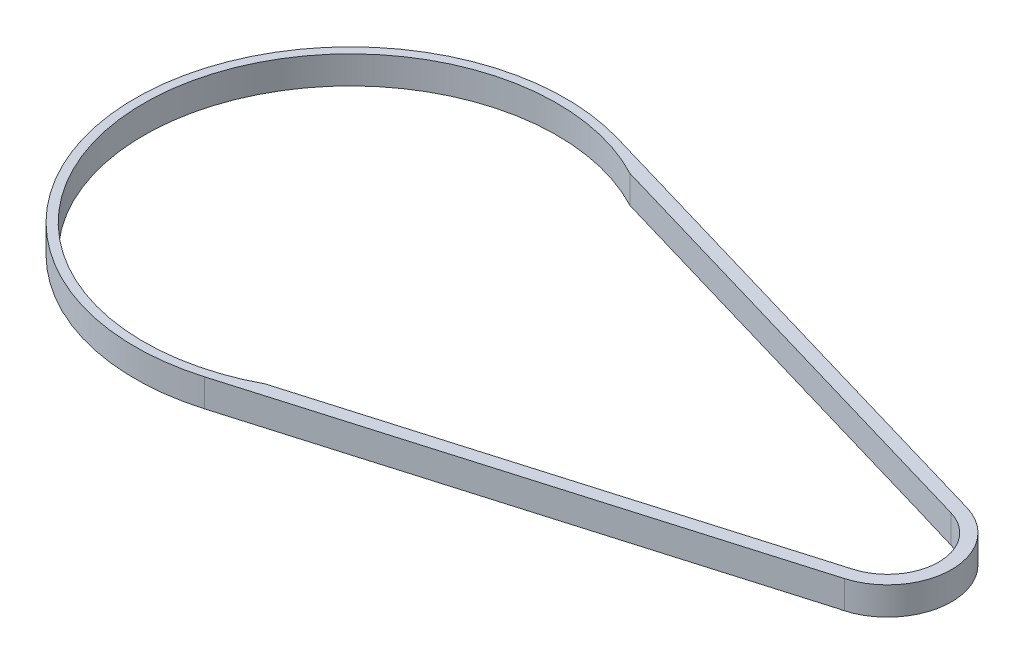
ISO-10303-21;
HEADER;
FILE_DESCRIPTION(('STEP AP214'),'2;1');
FILE_NAME('part.step','',(''),(''),'','','');
FILE_SCHEMA(('AUTOMOTIVE_DESIGN { 1 0 10303 214 1 1 1 1 }'));
ENDSEC;
DATA;
#1=APPLICATION_CONTEXT('core data for automotive mechanical design processes');
#2=APPLICATION_PROTOCOL_DEFINITION('international standard','automotive_design',2000,#1);
#3=PRODUCT_CONTEXT('',#1,'mechanical');
#4=PRODUCT('Part','Part','',(#3));
#5=PRODUCT_RELATED_PRODUCT_CATEGORY('part','',(#4));
#6=PRODUCT_DEFINITION_FORMATION('','',#4);
#7=PRODUCT_DEFINITION_CONTEXT('part definition',#1,'design');
#8=PRODUCT_DEFINITION('design','',#6,#7);
#9=PRODUCT_DEFINITION_SHAPE('','',#8);
#10=(LENGTH_UNIT() NAMED_UNIT(*) SI_UNIT(.MILLI.,.METRE.));
#11=(NAMED_UNIT(*) PLANE_ANGLE_UNIT() SI_UNIT($,.RADIAN.));
#12=(NAMED_UNIT(*) SI_UNIT($,.STERADIAN.) SOLID_ANGLE_UNIT());
#13=UNCERTAINTY_MEASURE_WITH_UNIT(LENGTH_MEASURE(1.E-05),#10,'distance_accuracy_value','');
#14=(GEOMETRIC_REPRESENTATION_CONTEXT(3) GLOBAL_UNCERTAINTY_ASSIGNED_CONTEXT((#13)) GLOBAL_UNIT_ASSIGNED_CONTEXT((#10,
#11,#12)) REPRESENTATION_CONTEXT('',''));
#15=CARTESIAN_POINT('',(0.,0.,0.));
#16=DIRECTION('',(0.,0.,1.));
#17=DIRECTION('',(1.,0.,0.));
#18=AXIS2_PLACEMENT_3D('',#15,#16,#17);
#19=CARTESIAN_POINT('',(208.585951979482,6.93358908423875,-38.8853206716041));
#20=DIRECTION('',(0.,1.,0.));
#21=DIRECTION('',(0.,0.,1.));
#22=AXIS2_PLACEMENT_3D('',#19,#20,#21);
#23=CYLINDRICAL_SURFACE('',#22,11.85);
#24=CARTESIAN_POINT('',(208.585951979482,6.93358908423875,-38.8853206716041));
#25=DIRECTION('',(0.,-1.,0.));
#26=DIRECTION('',(0.,0.,-1.));
#27=AXIS2_PLACEMENT_3D('',#24,#25,#26);
#28=CIRCLE('',#27,11.85);
#29=CARTESIAN_POINT('',(211.923828913151,6.93358908423874,-50.2555043804835));
#30=VERTEX_POINT('',#29);
#31=CARTESIAN_POINT('',(211.923828913151,6.93358908423874,-27.5151369626262));
#32=VERTEX_POINT('',#31);
#33=EDGE_CURVE('E127',#30,#32,#28,.T.);
#34=ORIENTED_EDGE('',*,*,#33,.T.);
#35=DIRECTION('',(0.,1.,0.));
#36=VECTOR('',#35,1.);
#37=CARTESIAN_POINT('',(211.923828913151,6.93358908423874,-27.5151369626262));
#38=LINE('',#37,#36);
#39=CARTESIAN_POINT('',(211.923828913151,13.4335890842388,-27.5151369626262));
#40=VERTEX_POINT('',#39);
#41=EDGE_CURVE('E136',#32,#40,#38,.T.);
#42=ORIENTED_EDGE('',*,*,#41,.T.);
#43=CARTESIAN_POINT('',(208.585951979482,13.4335890842387,-38.8853206716041));
#44=DIRECTION('',(0.,-1.,0.));
#45=DIRECTION('',(0.,0.,-1.));
#46=AXIS2_PLACEMENT_3D('',#43,#44,#45);
#47=CIRCLE('',#46,11.85);
#48=CARTESIAN_POINT('',(211.923828913151,13.4335890842388,-50.2555043804835));
#49=VERTEX_POINT('',#48);
#50=EDGE_CURVE('E148',#49,#40,#47,.T.);
#51=ORIENTED_EDGE('',*,*,#50,.F.);
#52=DIRECTION('',(0.,1.,0.));
#53=VECTOR('',#52,1.);
#54=CARTESIAN_POINT('',(211.923828913151,6.93358908423874,-50.2555043804835));
#55=LINE('',#54,#53);
#56=EDGE_CURVE('E143',#30,#49,#55,.T.);
#57=ORIENTED_EDGE('',*,*,#56,.F.);
#58=EDGE_LOOP('',(#34,#42,#51,#57));
#59=FACE_BOUND('',#58,.T.);
#60=ADVANCED_FACE('F39',(#59),#23,.F.);
#61=CARTESIAN_POINT('',(83.7764047817874,6.98358908423875,-38.8853206715993));
#62=DIRECTION('',(0.,1.,0.));
#63=DIRECTION('',(0.,0.,1.));
#64=AXIS2_PLACEMENT_3D('',#61,#62,#63);
#65=CYLINDRICAL_SURFACE('',#64,50.00602605);
#66=CARTESIAN_POINT('',(83.7764047817874,6.98358908423875,-38.8853206715993));
#67=DIRECTION('',(0.,-1.,0.));
#68=DIRECTION('',(0.,0.,-1.));
#69=AXIS2_PLACEMENT_3D('',#66,#67,#68);
#70=CIRCLE('',#69,50.00602605);
#71=CARTESIAN_POINT('',(97.861971102174,6.98358908423875,9.09592006628987));
#72=VERTEX_POINT('',#71);
#73=CARTESIAN_POINT('',(97.861971102174,6.98358908423879,-86.8665614094884));
#74=VERTEX_POINT('',#73);
#75=EDGE_CURVE('E12',#72,#74,#70,.T.);
#76=ORIENTED_EDGE('',*,*,#75,.F.);
#77=DIRECTION('',(0.,-1.,0.));
#78=VECTOR('',#77,1.);
#79=CARTESIAN_POINT('',(97.861971102174,133.29070056636,9.09592006628996));
#80=LINE('',#79,#78);
#81=CARTESIAN_POINT('',(97.861971102174,13.4335890842388,9.09592006628988));
#82=VERTEX_POINT('',#81);
#83=EDGE_CURVE('E166',#82,#72,#80,.T.);
#84=ORIENTED_EDGE('',*,*,#83,.F.);
#85=CARTESIAN_POINT('',(83.7764047817874,13.4335890842388,-38.8853206715993));
#86=DIRECTION('',(0.,-1.,0.));
#87=DIRECTION('',(0.,0.,-1.));
#88=AXIS2_PLACEMENT_3D('',#85,#86,#87);
#89=CIRCLE('',#88,50.00602605);
#90=CARTESIAN_POINT('',(97.861971102174,13.4335890842388,-86.8665614094884));
#91=VERTEX_POINT('',#90);
#92=EDGE_CURVE('E48',#82,#91,#89,.T.);
#93=ORIENTED_EDGE('',*,*,#92,.T.);
#94=DIRECTION('',(0.,-1.,0.));
#95=VECTOR('',#94,1.);
#96=CARTESIAN_POINT('',(97.861971102174,133.29070056636,-86.8665614094883));
#97=LINE('',#96,#95);
#98=EDGE_CURVE('E163',#91,#74,#97,.T.);
#99=ORIENTED_EDGE('',*,*,#98,.T.);
#100=EDGE_LOOP('',(#76,#84,#93,#99));
#101=FACE_BOUND('',#100,.T.);
#102=ADVANCED_FACE('F41',(#101),#65,.T.);
#103=CARTESIAN_POINT('',(208.585951979482,6.93358908423875,-38.8853206716041));
#104=DIRECTION('',(0.,1.,0.));
#105=DIRECTION('',(0.,0.,1.));
#106=AXIS2_PLACEMENT_3D('',#103,#104,#105);
#107=CYLINDRICAL_SURFACE('',#106,14.85);
#108=CARTESIAN_POINT('',(208.585951979482,6.98358908423874,-38.8853206716038));
#109=DIRECTION('',(0.,1.,0.));
#110=DIRECTION('',(0.,0.,1.));
#111=AXIS2_PLACEMENT_3D('',#108,#109,#110);
#112=CIRCLE('',#111,14.8500000000089);
#113=CARTESIAN_POINT('',(203.336355818768,6.98358908423873,-24.9941637669511));
#114=VERTEX_POINT('',#113);
#115=CARTESIAN_POINT('',(212.768861048253,6.98358908423873,-24.6366094413675));
#116=VERTEX_POINT('',#115);
#117=EDGE_CURVE('E174',#114,#116,#112,.T.);
#118=ORIENTED_EDGE('',*,*,#117,.F.);
#119=DIRECTION('',(0.,-1.,0.));
#120=VECTOR('',#119,1.);
#121=CARTESIAN_POINT('',(203.336355818783,13.4335890842389,-24.9941637669553));
#122=LINE('',#121,#120);
#123=CARTESIAN_POINT('',(203.336355818783,6.93358908423875,-24.9941637669553));
#124=VERTEX_POINT('',#123);
#125=EDGE_CURVE('E185',#114,#124,#122,.T.);
#126=ORIENTED_EDGE('',*,*,#125,.T.);
#127=CARTESIAN_POINT('',(208.585951979482,6.93358908423875,-38.8853206716041));
#128=DIRECTION('',(0.,-1.,0.));
#129=DIRECTION('',(-1.,0.,0.));
#130=AXIS2_PLACEMENT_3D('',#127,#128,#129);
#131=CIRCLE('',#130,14.85);
#132=CARTESIAN_POINT('',(203.336355818768,6.93358908423874,-52.7764775762474));
#133=VERTEX_POINT('',#132);
#134=EDGE_CURVE('E129',#133,#124,#131,.T.);
#135=ORIENTED_EDGE('',*,*,#134,.F.);
#136=DIRECTION('',(0.,-1.,0.));
#137=VECTOR('',#136,1.);
#138=CARTESIAN_POINT('',(203.336355818768,13.4335890842388,-52.7764775762474));
#139=LINE('',#138,#137);
#140=CARTESIAN_POINT('',(203.336355818768,6.98358908423875,-52.7764775762474));
#141=VERTEX_POINT('',#140);
#142=EDGE_CURVE('E132',#141,#133,#139,.T.);
#143=ORIENTED_EDGE('',*,*,#142,.F.);
#144=CARTESIAN_POINT('',(208.585951979482,6.98358908423874,-38.8853206716038));
#145=DIRECTION('',(0.,1.,0.));
#146=DIRECTION('',(0.,0.,-1.));
#147=AXIS2_PLACEMENT_3D('',#144,#145,#146);
#148=CIRCLE('',#147,14.8500000000003);
#149=CARTESIAN_POINT('',(212.768861048253,6.98358908423875,-53.134031901831));
#150=VERTEX_POINT('',#149);
#151=EDGE_CURVE('E217',#150,#141,#148,.T.);
#152=ORIENTED_EDGE('',*,*,#151,.F.);
#153=DIRECTION('',(0.,-1.,0.));
#154=VECTOR('',#153,1.);
#155=CARTESIAN_POINT('',(212.768861048253,133.29070056636,-53.1340319018309));
#156=LINE('',#155,#154);
#157=CARTESIAN_POINT('',(212.768861048253,13.4335890842388,-53.134031901831));
#158=VERTEX_POINT('',#157);
#159=EDGE_CURVE('E164',#158,#150,#156,.T.);
#160=ORIENTED_EDGE('',*,*,#159,.F.);
#161=CARTESIAN_POINT('',(208.585951979482,13.4335890842387,-38.8853206716041));
#162=DIRECTION('',(0.,-1.,0.));
#163=DIRECTION('',(-1.,0.,0.));
#164=AXIS2_PLACEMENT_3D('',#161,#162,#163);
#165=CIRCLE('',#164,14.85);
#166=CARTESIAN_POINT('',(212.768861048253,13.4335890842388,-24.6366094413675));
#167=VERTEX_POINT('',#166);
#168=EDGE_CURVE('E147',#158,#167,#165,.T.);
#169=ORIENTED_EDGE('',*,*,#168,.T.);
#170=DIRECTION('',(0.,-1.,0.));
#171=VECTOR('',#170,1.);
#172=CARTESIAN_POINT('',(212.768861048253,133.29070056636,-24.6366094413674));
#173=LINE('',#172,#171);
#174=EDGE_CURVE('E152',#167,#116,#173,.T.);
#175=ORIENTED_EDGE('',*,*,#174,.T.);
#176=EDGE_LOOP('',(#118,#126,#135,#143,#152,#160,#169,#175));
#177=FACE_BOUND('',#176,.T.);
#178=ADVANCED_FACE('F226',(#177),#107,.T.);
#179=CARTESIAN_POINT('',(83.7764047817874,6.98358908423875,-38.8853206715993));
#180=DIRECTION('',(0.,-1.,0.));
#181=DIRECTION('',(0.,0.,-1.));
#182=AXIS2_PLACEMENT_3D('',#179,#180,#181);
#183=PLANE('',#182);
#184=DIRECTION('',(-0.959509173752653,0.,-0.281677378368413));
#185=VECTOR('',#184,1.);
#186=CARTESIAN_POINT('',(113.385956141157,6.98358908423878,-79.1826792650621));
#187=LINE('',#186,#185);
#188=CARTESIAN_POINT('',(106.369670762619,6.98358908423879,-81.2424082654444));
#189=VERTEX_POINT('',#188);
#190=EDGE_CURVE('E214',#141,#189,#187,.T.);
#191=ORIENTED_EDGE('',*,*,#190,.T.);
#192=CARTESIAN_POINT('',(83.7764047817874,6.98358908423875,-38.8853206715993));
#193=DIRECTION('',(0.,-1.,0.));
#194=DIRECTION('',(0.,0.,-1.));
#195=AXIS2_PLACEMENT_3D('',#192,#193,#194);
#196=CIRCLE('',#195,48.00602605);
#197=CARTESIAN_POINT('',(106.369670762619,6.98358908423873,3.47176692224591));
#198=VERTEX_POINT('',#197);
#199=EDGE_CURVE('E206',#198,#189,#196,.T.);
#200=ORIENTED_EDGE('',*,*,#199,.F.);
#201=DIRECTION('',(0.959509173752653,0.,-0.281677378368413));
#202=VECTOR('',#201,1.);
#203=CARTESIAN_POINT('',(113.385956141157,6.98358908423873,1.41203792186365));
#204=LINE('',#203,#202);
#205=EDGE_CURVE('E171',#198,#114,#204,.T.);
#206=ORIENTED_EDGE('',*,*,#205,.T.);
#207=ORIENTED_EDGE('',*,*,#117,.T.);
#208=DIRECTION('',(-0.959509173752653,0.,0.281677378368413));
#209=VECTOR('',#208,1.);
#210=CARTESIAN_POINT('',(97.861971102174,6.98358908423873,9.09592006628988));
#211=LINE('',#210,#209);
#212=EDGE_CURVE('E177',#116,#72,#211,.T.);
#213=ORIENTED_EDGE('',*,*,#212,.T.);
#214=ORIENTED_EDGE('',*,*,#75,.T.);
#215=DIRECTION('',(0.959509173752653,0.,0.281677378368413));
#216=VECTOR('',#215,1.);
#217=CARTESIAN_POINT('',(97.861971102174,6.98358908423879,-86.8665614094884));
#218=LINE('',#217,#216);
#219=EDGE_CURVE('E215',#74,#150,#218,.T.);
#220=ORIENTED_EDGE('',*,*,#219,.T.);
#221=ORIENTED_EDGE('',*,*,#151,.T.);
#222=EDGE_LOOP('',(#191,#200,#206,#207,#213,#214,#220,#221));
#223=FACE_BOUND('',#222,.T.);
#224=ADVANCED_FACE('F221',(#223),#183,.T.);
#225=CARTESIAN_POINT('',(83.7764047817874,13.4335890842388,-38.8853206715993));
#226=DIRECTION('',(0.,-1.,0.));
#227=DIRECTION('',(0.,0.,-1.));
#228=AXIS2_PLACEMENT_3D('',#225,#226,#227);
#229=PLANE('',#228);
#230=ORIENTED_EDGE('',*,*,#50,.T.);
#231=DIRECTION('',(0.959509173752653,0.,-0.281677378368413));
#232=VECTOR('',#231,1.);
#233=CARTESIAN_POINT('',(113.385956141157,13.4335890842387,1.41203792186365));
#234=LINE('',#233,#232);
#235=CARTESIAN_POINT('',(106.369670762619,13.4335890842388,3.47176692224591));
#236=VERTEX_POINT('',#235);
#237=EDGE_CURVE('E139',#236,#40,#234,.T.);
#238=ORIENTED_EDGE('',*,*,#237,.F.);
#239=CARTESIAN_POINT('',(83.7764047817874,13.4335890842388,-38.8853206715993));
#240=DIRECTION('',(0.,-1.,0.));
#241=DIRECTION('',(0.,0.,-1.));
#242=AXIS2_PLACEMENT_3D('',#239,#240,#241);
#243=CIRCLE('',#242,48.00602605);
#244=CARTESIAN_POINT('',(106.369670762619,13.4335890842388,-81.2424082654444));
#245=VERTEX_POINT('',#244);
#246=EDGE_CURVE('E204',#236,#245,#243,.T.);
#247=ORIENTED_EDGE('',*,*,#246,.T.);
#248=DIRECTION('',(-0.959509173752653,0.,-0.281677378368413));
#249=VECTOR('',#248,1.);
#250=CARTESIAN_POINT('',(113.385956141157,13.4335890842387,-79.1826792650621));
#251=LINE('',#250,#249);
#252=EDGE_CURVE('E161',#49,#245,#251,.T.);
#253=ORIENTED_EDGE('',*,*,#252,.F.);
#254=EDGE_LOOP('',(#230,#238,#247,#253));
#255=FACE_BOUND('',#254,.T.);
#256=ORIENTED_EDGE('',*,*,#92,.F.);
#257=DIRECTION('',(-0.959509173752653,0.,0.281677378368413));
#258=VECTOR('',#257,1.);
#259=CARTESIAN_POINT('',(97.861971102174,13.4335890842388,9.09592006628989));
#260=LINE('',#259,#258);
#261=EDGE_CURVE('E168',#167,#82,#260,.T.);
#262=ORIENTED_EDGE('',*,*,#261,.F.);
#263=ORIENTED_EDGE('',*,*,#168,.F.);
#264=DIRECTION('',(0.959509173752653,0.,0.281677378368413));
#265=VECTOR('',#264,1.);
#266=CARTESIAN_POINT('',(97.8619711021741,13.4335890842388,-86.8665614094884));
#267=LINE('',#266,#265);
#268=EDGE_CURVE('E74',#91,#158,#267,.T.);
#269=ORIENTED_EDGE('',*,*,#268,.F.);
#270=EDGE_LOOP('',(#256,#262,#263,#269));
#271=FACE_BOUND('',#270,.T.);
#272=ADVANCED_FACE('F200',(#255,#271),#229,.F.);
#273=CARTESIAN_POINT('',(83.7764047817874,6.98358908423875,-38.8853206715993));
#274=DIRECTION('',(0.,1.,0.));
#275=DIRECTION('',(0.,0.,1.));
#276=AXIS2_PLACEMENT_3D('',#273,#274,#275);
#277=CYLINDRICAL_SURFACE('',#276,48.00602605);
#278=DIRECTION('',(0.,-1.,0.));
#279=VECTOR('',#278,1.);
#280=CARTESIAN_POINT('',(106.369670762619,13.4335890842388,-81.2424082654444));
#281=LINE('',#280,#279);
#282=EDGE_CURVE('E178',#245,#189,#281,.T.);
#283=ORIENTED_EDGE('',*,*,#282,.F.);
#284=ORIENTED_EDGE('',*,*,#246,.F.);
#285=DIRECTION('',(0.,-1.,0.));
#286=VECTOR('',#285,1.);
#287=CARTESIAN_POINT('',(106.369670762619,13.4335890842388,3.47176692224591));
#288=LINE('',#287,#286);
#289=EDGE_CURVE('E182',#236,#198,#288,.T.);
#290=ORIENTED_EDGE('',*,*,#289,.T.);
#291=ORIENTED_EDGE('',*,*,#199,.T.);
#292=EDGE_LOOP('',(#283,#284,#290,#291));
#293=FACE_BOUND('',#292,.T.);
#294=ADVANCED_FACE('F223',(#293),#277,.F.);
#295=CARTESIAN_POINT('',(97.861971102174,133.29070056636,-86.8665614094883));
#296=DIRECTION('',(0.281677378368413,0.,-0.959509173752652));
#297=DIRECTION('',(-0.959509173752653,0.,-0.281677378368413));
#298=AXIS2_PLACEMENT_3D('',#295,#296,#297);
#299=PLANE('',#298);
#300=ORIENTED_EDGE('',*,*,#98,.F.);
#301=ORIENTED_EDGE('',*,*,#268,.T.);
#302=ORIENTED_EDGE('',*,*,#159,.T.);
#303=ORIENTED_EDGE('',*,*,#219,.F.);
#304=EDGE_LOOP('',(#300,#301,#302,#303));
#305=FACE_BOUND('',#304,.T.);
#306=ADVANCED_FACE('F246',(#305),#299,.T.);
#307=CARTESIAN_POINT('',(113.385956141157,133.29070056636,-79.182679265062));
#308=DIRECTION('',(-0.281677378368413,0.,0.959509173752653));
#309=DIRECTION('',(0.959509173752653,0.,0.281677378368413));
#310=AXIS2_PLACEMENT_3D('',#307,#308,#309);
#311=PLANE('',#310);
#312=ORIENTED_EDGE('',*,*,#190,.F.);
#313=ORIENTED_EDGE('',*,*,#142,.T.);
#314=DIRECTION('',(0.959509173754414,0.,0.281677378362412));
#315=VECTOR('',#314,1.);
#316=CARTESIAN_POINT('',(203.336355818768,6.93358908423874,-52.7764775762474));
#317=LINE('',#316,#315);
#318=EDGE_CURVE('E133',#133,#30,#317,.T.);
#319=ORIENTED_EDGE('',*,*,#318,.T.);
#320=ORIENTED_EDGE('',*,*,#56,.T.);
#321=ORIENTED_EDGE('',*,*,#252,.T.);
#322=ORIENTED_EDGE('',*,*,#282,.T.);
#323=EDGE_LOOP('',(#312,#313,#319,#320,#321,#322));
#324=FACE_BOUND('',#323,.T.);
#325=ADVANCED_FACE('F197',(#324),#311,.T.);
#326=CARTESIAN_POINT('',(208.585951979482,6.93358908423875,-38.8853206716041));
#327=DIRECTION('',(0.,-1.,0.));
#328=DIRECTION('',(0.,0.,-1.));
#329=AXIS2_PLACEMENT_3D('',#326,#327,#328);
#330=PLANE('',#329);
#331=DIRECTION('',(-0.959509173752653,0.,0.281677378368413));
#332=VECTOR('',#331,1.);
#333=CARTESIAN_POINT('',(203.336355818783,6.93358908423875,-24.9941637669553));
#334=LINE('',#333,#332);
#335=EDGE_CURVE('E122',#32,#124,#334,.T.);
#336=ORIENTED_EDGE('',*,*,#335,.F.);
#337=ORIENTED_EDGE('',*,*,#33,.F.);
#338=ORIENTED_EDGE('',*,*,#318,.F.);
#339=ORIENTED_EDGE('',*,*,#134,.T.);
#340=EDGE_LOOP('',(#336,#337,#338,#339));
#341=FACE_BOUND('',#340,.T.);
#342=ADVANCED_FACE('F124',(#341),#330,.T.);
#343=CARTESIAN_POINT('',(97.861971102174,133.29070056636,9.09592006628996));
#344=DIRECTION('',(0.281677378368413,0.,0.959509173752652));
#345=DIRECTION('',(0.959509173752653,0.,-0.281677378368413));
#346=AXIS2_PLACEMENT_3D('',#343,#344,#345);
#347=PLANE('',#346);
#348=ORIENTED_EDGE('',*,*,#174,.F.);
#349=ORIENTED_EDGE('',*,*,#261,.T.);
#350=ORIENTED_EDGE('',*,*,#83,.T.);
#351=ORIENTED_EDGE('',*,*,#212,.F.);
#352=EDGE_LOOP('',(#348,#349,#350,#351));
#353=FACE_BOUND('',#352,.T.);
#354=ADVANCED_FACE('F229',(#353),#347,.T.);
#355=CARTESIAN_POINT('',(113.385956141157,133.29070056636,1.41203792186373));
#356=DIRECTION('',(-0.281677378368413,0.,-0.959509173752653));
#357=DIRECTION('',(-0.959509173752653,0.,0.281677378368413));
#358=AXIS2_PLACEMENT_3D('',#355,#356,#357);
#359=PLANE('',#358);
#360=ORIENTED_EDGE('',*,*,#205,.F.);
#361=ORIENTED_EDGE('',*,*,#289,.F.);
#362=ORIENTED_EDGE('',*,*,#237,.T.);
#363=ORIENTED_EDGE('',*,*,#41,.F.);
#364=ORIENTED_EDGE('',*,*,#335,.T.);
#365=ORIENTED_EDGE('',*,*,#125,.F.);
#366=EDGE_LOOP('',(#360,#361,#362,#363,#364,#365));
#367=FACE_BOUND('',#366,.T.);
#368=ADVANCED_FACE('F137',(#367),#359,.T.);
#369=CLOSED_SHELL('',(#60,#102,#178,#224,#272,#294,#306,#325,#342,#354,#368));
#370=MANIFOLD_SOLID_BREP('B2',#369);
#371=ADVANCED_BREP_SHAPE_REPRESENTATION('',(#18,#370),#14);
#372=SHAPE_DEFINITION_REPRESENTATION(#9,#371);
ENDSEC;
END-ISO-10303-21;
